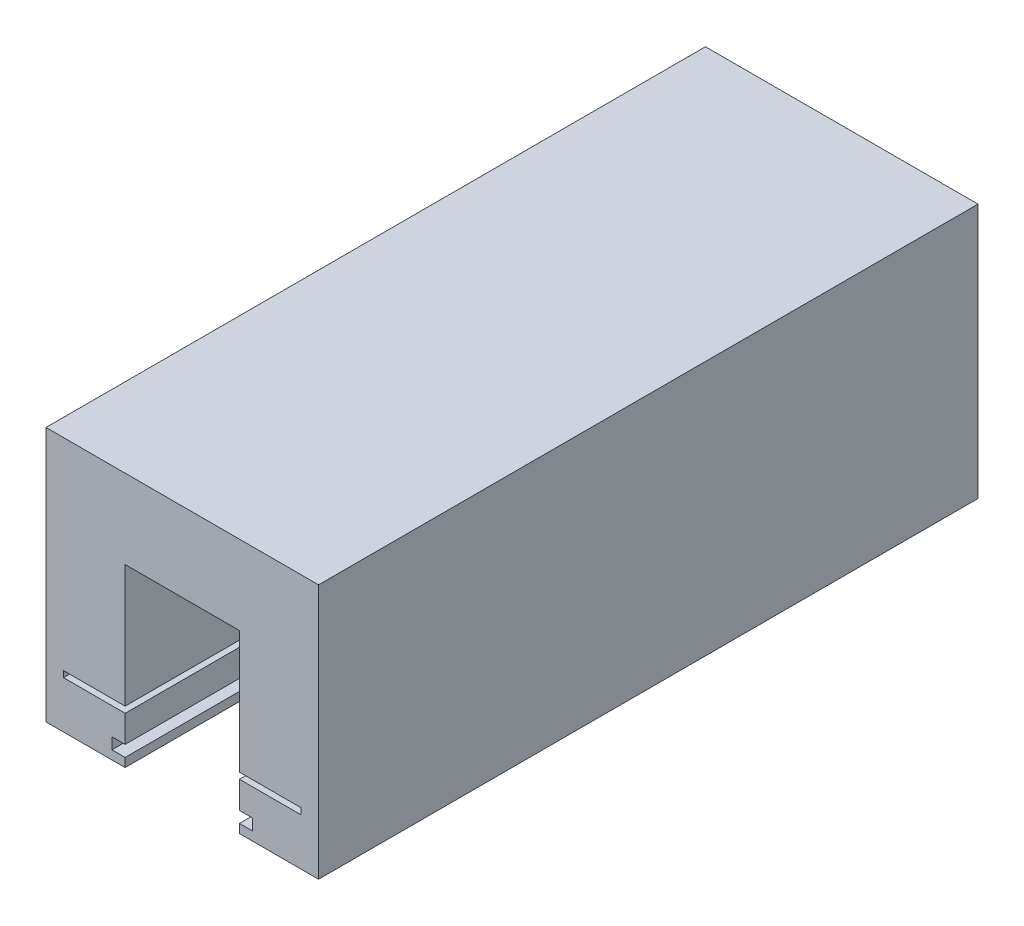
ISO-10303-21;
HEADER;
FILE_DESCRIPTION(('STEP AP214'),'2;1');
FILE_NAME('part.step','',(''),(''),'','','');
FILE_SCHEMA(('AUTOMOTIVE_DESIGN { 1 0 10303 214 1 1 1 1 }'));
ENDSEC;
DATA;
#1=APPLICATION_CONTEXT('core data for automotive mechanical design processes');
#2=APPLICATION_PROTOCOL_DEFINITION('international standard','automotive_design',2000,#1);
#3=PRODUCT_CONTEXT('',#1,'mechanical');
#4=PRODUCT('Part','Part','',(#3));
#5=PRODUCT_RELATED_PRODUCT_CATEGORY('part','',(#4));
#6=PRODUCT_DEFINITION_FORMATION('','',#4);
#7=PRODUCT_DEFINITION_CONTEXT('part definition',#1,'design');
#8=PRODUCT_DEFINITION('design','',#6,#7);
#9=PRODUCT_DEFINITION_SHAPE('','',#8);
#10=(LENGTH_UNIT() NAMED_UNIT(*) SI_UNIT(.MILLI.,.METRE.));
#11=(NAMED_UNIT(*) PLANE_ANGLE_UNIT() SI_UNIT($,.RADIAN.));
#12=(NAMED_UNIT(*) SI_UNIT($,.STERADIAN.) SOLID_ANGLE_UNIT());
#13=UNCERTAINTY_MEASURE_WITH_UNIT(LENGTH_MEASURE(1.E-05),#10,'distance_accuracy_value','');
#14=(GEOMETRIC_REPRESENTATION_CONTEXT(3) GLOBAL_UNCERTAINTY_ASSIGNED_CONTEXT((#13)) GLOBAL_UNIT_ASSIGNED_CONTEXT((#10,
#11,#12)) REPRESENTATION_CONTEXT('',''));
#15=CARTESIAN_POINT('',(0.,0.,0.));
#16=DIRECTION('',(0.,0.,1.));
#17=DIRECTION('',(1.,0.,0.));
#18=AXIS2_PLACEMENT_3D('',#15,#16,#17);
#19=CARTESIAN_POINT('',(0.,6.04999999999999,75.));
#20=DIRECTION('',(0.,-1.,0.));
#21=DIRECTION('',(1.,0.,0.));
#22=AXIS2_PLACEMENT_3D('',#19,#20,#21);
#23=PLANE('',#22);
#24=DIRECTION('',(-1.,0.,0.));
#25=VECTOR('',#24,1.);
#26=CARTESIAN_POINT('',(0.,6.04999999999999,0.));
#27=LINE('',#26,#25);
#28=CARTESIAN_POINT('',(-2.,6.04999999999999,0.));
#29=VERTEX_POINT('',#28);
#30=CARTESIAN_POINT('',(-9.,6.04999999999999,0.));
#31=VERTEX_POINT('',#30);
#32=EDGE_CURVE('E228',#29,#31,#27,.T.);
#33=ORIENTED_EDGE('',*,*,#32,.F.);
#34=DIRECTION('',(0.,0.,-1.));
#35=VECTOR('',#34,1.);
#36=CARTESIAN_POINT('',(-2.,6.04999999999999,75.));
#37=LINE('',#36,#35);
#38=CARTESIAN_POINT('',(-2.,6.04999999999999,75.));
#39=VERTEX_POINT('',#38);
#40=EDGE_CURVE('E11',#39,#29,#37,.T.);
#41=ORIENTED_EDGE('',*,*,#40,.F.);
#42=DIRECTION('',(-1.,0.,0.));
#43=VECTOR('',#42,1.);
#44=CARTESIAN_POINT('',(0.,6.04999999999999,75.));
#45=LINE('',#44,#43);
#46=CARTESIAN_POINT('',(-9.,6.04999999999999,75.));
#47=VERTEX_POINT('',#46);
#48=EDGE_CURVE('E351',#39,#47,#45,.T.);
#49=ORIENTED_EDGE('',*,*,#48,.T.);
#50=DIRECTION('',(0.,0.,-1.));
#51=VECTOR('',#50,1.);
#52=CARTESIAN_POINT('',(-9.,6.04999999999999,75.));
#53=LINE('',#52,#51);
#54=EDGE_CURVE('E51',#47,#31,#53,.T.);
#55=ORIENTED_EDGE('',*,*,#54,.T.);
#56=EDGE_LOOP('',(#33,#41,#49,#55));
#57=FACE_BOUND('',#56,.T.);
#58=ADVANCED_FACE('F35',(#57),#23,.T.);
#59=CARTESIAN_POINT('',(-2.,0.,75.));
#60=DIRECTION('',(-1.,0.,0.));
#61=DIRECTION('',(0.,0.,1.));
#62=AXIS2_PLACEMENT_3D('',#59,#60,#61);
#63=PLANE('',#62);
#64=DIRECTION('',(0.,1.,0.));
#65=VECTOR('',#64,1.);
#66=CARTESIAN_POINT('',(-2.,0.,0.));
#67=LINE('',#66,#65);
#68=CARTESIAN_POINT('',(-2.,5.34999999999999,0.));
#69=VERTEX_POINT('',#68);
#70=EDGE_CURVE('E230',#69,#29,#67,.T.);
#71=ORIENTED_EDGE('',*,*,#70,.F.);
#72=DIRECTION('',(0.,0.,-1.));
#73=VECTOR('',#72,1.);
#74=CARTESIAN_POINT('',(-2.,5.34999999999999,75.));
#75=LINE('',#74,#73);
#76=CARTESIAN_POINT('',(-2.,5.34999999999999,75.));
#77=VERTEX_POINT('',#76);
#78=EDGE_CURVE('E43',#77,#69,#75,.T.);
#79=ORIENTED_EDGE('',*,*,#78,.F.);
#80=DIRECTION('',(0.,1.,0.));
#81=VECTOR('',#80,1.);
#82=CARTESIAN_POINT('',(-2.,0.,75.));
#83=LINE('',#82,#81);
#84=EDGE_CURVE('E348',#77,#39,#83,.T.);
#85=ORIENTED_EDGE('',*,*,#84,.T.);
#86=ORIENTED_EDGE('',*,*,#40,.T.);
#87=EDGE_LOOP('',(#71,#79,#85,#86));
#88=FACE_BOUND('',#87,.T.);
#89=ADVANCED_FACE('F337',(#88),#63,.T.);
#90=CARTESIAN_POINT('',(0.,5.34999999999999,75.));
#91=DIRECTION('',(0.,1.,0.));
#92=DIRECTION('',(0.,0.,1.));
#93=AXIS2_PLACEMENT_3D('',#90,#91,#92);
#94=PLANE('',#93);
#95=DIRECTION('',(1.,0.,0.));
#96=VECTOR('',#95,1.);
#97=CARTESIAN_POINT('',(0.,5.34999999999999,0.));
#98=LINE('',#97,#96);
#99=CARTESIAN_POINT('',(-9.,5.34999999999999,0.));
#100=VERTEX_POINT('',#99);
#101=EDGE_CURVE('E233',#100,#69,#98,.T.);
#102=ORIENTED_EDGE('',*,*,#101,.F.);
#103=DIRECTION('',(0.,0.,-1.));
#104=VECTOR('',#103,1.);
#105=CARTESIAN_POINT('',(-9.,5.34999999999999,75.));
#106=LINE('',#105,#104);
#107=CARTESIAN_POINT('',(-9.,5.34999999999999,75.));
#108=VERTEX_POINT('',#107);
#109=EDGE_CURVE('E326',#108,#100,#106,.T.);
#110=ORIENTED_EDGE('',*,*,#109,.F.);
#111=DIRECTION('',(1.,0.,0.));
#112=VECTOR('',#111,1.);
#113=CARTESIAN_POINT('',(0.,5.34999999999999,75.));
#114=LINE('',#113,#112);
#115=EDGE_CURVE('E333',#108,#77,#114,.T.);
#116=ORIENTED_EDGE('',*,*,#115,.T.);
#117=ORIENTED_EDGE('',*,*,#78,.T.);
#118=EDGE_LOOP('',(#102,#110,#116,#117));
#119=FACE_BOUND('',#118,.T.);
#120=ADVANCED_FACE('F331',(#119),#94,.T.);
#121=CARTESIAN_POINT('',(-9.,0.,75.));
#122=DIRECTION('',(-1.,0.,0.));
#123=DIRECTION('',(0.,0.,1.));
#124=AXIS2_PLACEMENT_3D('',#121,#122,#123);
#125=PLANE('',#124);
#126=DIRECTION('',(0.,1.,0.));
#127=VECTOR('',#126,1.);
#128=CARTESIAN_POINT('',(-9.,0.,0.));
#129=LINE('',#128,#127);
#130=CARTESIAN_POINT('',(-9.,2.28,0.));
#131=VERTEX_POINT('',#130);
#132=EDGE_CURVE('E236',#131,#100,#129,.T.);
#133=ORIENTED_EDGE('',*,*,#132,.F.);
#134=DIRECTION('',(0.,0.,-1.));
#135=VECTOR('',#134,1.);
#136=CARTESIAN_POINT('',(-9.,2.28,75.));
#137=LINE('',#136,#135);
#138=CARTESIAN_POINT('',(-9.,2.28,75.));
#139=VERTEX_POINT('',#138);
#140=EDGE_CURVE('E324',#139,#131,#137,.T.);
#141=ORIENTED_EDGE('',*,*,#140,.F.);
#142=DIRECTION('',(0.,1.,0.));
#143=VECTOR('',#142,1.);
#144=CARTESIAN_POINT('',(-9.,0.,75.));
#145=LINE('',#144,#143);
#146=EDGE_CURVE('E224',#139,#108,#145,.T.);
#147=ORIENTED_EDGE('',*,*,#146,.T.);
#148=ORIENTED_EDGE('',*,*,#109,.T.);
#149=EDGE_LOOP('',(#133,#141,#147,#148));
#150=FACE_BOUND('',#149,.T.);
#151=ADVANCED_FACE('F343',(#150),#125,.T.);
#152=CARTESIAN_POINT('',(0.,2.28,75.));
#153=DIRECTION('',(0.,-1.,0.));
#154=DIRECTION('',(0.,0.,-1.));
#155=AXIS2_PLACEMENT_3D('',#152,#153,#154);
#156=PLANE('',#155);
#157=DIRECTION('',(-1.,0.,0.));
#158=VECTOR('',#157,1.);
#159=CARTESIAN_POINT('',(0.,2.28,0.));
#160=LINE('',#159,#158);
#161=CARTESIAN_POINT('',(-7.5,2.28,0.));
#162=VERTEX_POINT('',#161);
#163=EDGE_CURVE('E239',#162,#131,#160,.T.);
#164=ORIENTED_EDGE('',*,*,#163,.F.);
#165=DIRECTION('',(0.,0.,-1.));
#166=VECTOR('',#165,1.);
#167=CARTESIAN_POINT('',(-7.5,2.28,75.));
#168=LINE('',#167,#166);
#169=CARTESIAN_POINT('',(-7.5,2.28,75.));
#170=VERTEX_POINT('',#169);
#171=EDGE_CURVE('E322',#170,#162,#168,.T.);
#172=ORIENTED_EDGE('',*,*,#171,.F.);
#173=DIRECTION('',(-1.,0.,0.));
#174=VECTOR('',#173,1.);
#175=CARTESIAN_POINT('',(0.,2.28,75.));
#176=LINE('',#175,#174);
#177=EDGE_CURVE('E350',#170,#139,#176,.T.);
#178=ORIENTED_EDGE('',*,*,#177,.T.);
#179=ORIENTED_EDGE('',*,*,#140,.T.);
#180=EDGE_LOOP('',(#164,#172,#178,#179));
#181=FACE_BOUND('',#180,.T.);
#182=ADVANCED_FACE('F460',(#181),#156,.T.);
#183=CARTESIAN_POINT('',(-7.5,0.,75.));
#184=DIRECTION('',(-1.,0.,0.));
#185=DIRECTION('',(0.,0.,1.));
#186=AXIS2_PLACEMENT_3D('',#183,#184,#185);
#187=PLANE('',#186);
#188=DIRECTION('',(0.,1.,0.));
#189=VECTOR('',#188,1.);
#190=CARTESIAN_POINT('',(-7.5,0.,0.));
#191=LINE('',#190,#189);
#192=CARTESIAN_POINT('',(-7.5,0.999999999999999,0.));
#193=VERTEX_POINT('',#192);
#194=EDGE_CURVE('E244',#193,#162,#191,.T.);
#195=ORIENTED_EDGE('',*,*,#194,.F.);
#196=DIRECTION('',(0.,0.,-1.));
#197=VECTOR('',#196,1.);
#198=CARTESIAN_POINT('',(-7.5,0.999999999999999,75.));
#199=LINE('',#198,#197);
#200=CARTESIAN_POINT('',(-7.5,0.999999999999999,75.));
#201=VERTEX_POINT('',#200);
#202=EDGE_CURVE('E320',#201,#193,#199,.T.);
#203=ORIENTED_EDGE('',*,*,#202,.F.);
#204=DIRECTION('',(0.,1.,0.));
#205=VECTOR('',#204,1.);
#206=CARTESIAN_POINT('',(-7.5,0.,75.));
#207=LINE('',#206,#205);
#208=EDGE_CURVE('E356',#201,#170,#207,.T.);
#209=ORIENTED_EDGE('',*,*,#208,.T.);
#210=ORIENTED_EDGE('',*,*,#171,.T.);
#211=EDGE_LOOP('',(#195,#203,#209,#210));
#212=FACE_BOUND('',#211,.T.);
#213=ADVANCED_FACE('F474',(#212),#187,.T.);
#214=CARTESIAN_POINT('',(0.,0.999999999999999,75.));
#215=DIRECTION('',(0.,1.,0.));
#216=DIRECTION('',(0.,0.,1.));
#217=AXIS2_PLACEMENT_3D('',#214,#215,#216);
#218=PLANE('',#217);
#219=DIRECTION('',(1.,0.,0.));
#220=VECTOR('',#219,1.);
#221=CARTESIAN_POINT('',(0.,0.999999999999999,0.));
#222=LINE('',#221,#220);
#223=CARTESIAN_POINT('',(-9.,0.999999999999999,0.));
#224=VERTEX_POINT('',#223);
#225=EDGE_CURVE('E247',#224,#193,#222,.T.);
#226=ORIENTED_EDGE('',*,*,#225,.F.);
#227=DIRECTION('',(0.,0.,-1.));
#228=VECTOR('',#227,1.);
#229=CARTESIAN_POINT('',(-9.,0.999999999999999,75.));
#230=LINE('',#229,#228);
#231=CARTESIAN_POINT('',(-9.,0.999999999999999,75.));
#232=VERTEX_POINT('',#231);
#233=EDGE_CURVE('E318',#232,#224,#230,.T.);
#234=ORIENTED_EDGE('',*,*,#233,.F.);
#235=DIRECTION('',(1.,0.,0.));
#236=VECTOR('',#235,1.);
#237=CARTESIAN_POINT('',(0.,0.999999999999999,75.));
#238=LINE('',#237,#236);
#239=EDGE_CURVE('E359',#232,#201,#238,.T.);
#240=ORIENTED_EDGE('',*,*,#239,.T.);
#241=ORIENTED_EDGE('',*,*,#202,.T.);
#242=EDGE_LOOP('',(#226,#234,#240,#241));
#243=FACE_BOUND('',#242,.T.);
#244=ADVANCED_FACE('F462',(#243),#218,.T.);
#245=CARTESIAN_POINT('',(-9.,0.,0.));
#246=VERTEX_POINT('',#245);
#247=EDGE_CURVE('E241',#246,#224,#129,.T.);
#248=ORIENTED_EDGE('',*,*,#247,.F.);
#249=DIRECTION('',(0.,0.,-1.));
#250=VECTOR('',#249,1.);
#251=CARTESIAN_POINT('',(-9.,0.,75.));
#252=LINE('',#251,#250);
#253=CARTESIAN_POINT('',(-9.,0.,75.));
#254=VERTEX_POINT('',#253);
#255=EDGE_CURVE('E316',#254,#246,#252,.T.);
#256=ORIENTED_EDGE('',*,*,#255,.F.);
#257=EDGE_CURVE('E223',#254,#232,#145,.T.);
#258=ORIENTED_EDGE('',*,*,#257,.T.);
#259=ORIENTED_EDGE('',*,*,#233,.T.);
#260=EDGE_LOOP('',(#248,#256,#258,#259));
#261=FACE_BOUND('',#260,.T.);
#262=ADVANCED_FACE('F447',(#261),#125,.T.);
#263=CARTESIAN_POINT('',(0.,0.,75.));
#264=DIRECTION('',(0.,-1.,0.));
#265=DIRECTION('',(1.,0.,0.));
#266=AXIS2_PLACEMENT_3D('',#263,#264,#265);
#267=PLANE('',#266);
#268=DIRECTION('',(-1.,0.,0.));
#269=VECTOR('',#268,1.);
#270=CARTESIAN_POINT('',(0.,0.,0.));
#271=LINE('',#270,#269);
#272=CARTESIAN_POINT('',(0.,0.,0.));
#273=VERTEX_POINT('',#272);
#274=EDGE_CURVE('E250',#273,#246,#271,.T.);
#275=ORIENTED_EDGE('',*,*,#274,.F.);
#276=DIRECTION('',(0.,0.,-1.));
#277=VECTOR('',#276,1.);
#278=CARTESIAN_POINT('',(0.,0.,75.));
#279=LINE('',#278,#277);
#280=CARTESIAN_POINT('',(0.,0.,75.));
#281=VERTEX_POINT('',#280);
#282=EDGE_CURVE('E314',#281,#273,#279,.T.);
#283=ORIENTED_EDGE('',*,*,#282,.F.);
#284=DIRECTION('',(-1.,0.,0.));
#285=VECTOR('',#284,1.);
#286=CARTESIAN_POINT('',(0.,0.,75.));
#287=LINE('',#286,#285);
#288=EDGE_CURVE('E362',#281,#254,#287,.T.);
#289=ORIENTED_EDGE('',*,*,#288,.T.);
#290=ORIENTED_EDGE('',*,*,#255,.T.);
#291=EDGE_LOOP('',(#275,#283,#289,#290));
#292=FACE_BOUND('',#291,.T.);
#293=ADVANCED_FACE('F442',(#292),#267,.T.);
#294=CARTESIAN_POINT('',(0.,0.,75.));
#295=DIRECTION('',(1.,0.,0.));
#296=DIRECTION('',(0.,0.,-1.));
#297=AXIS2_PLACEMENT_3D('',#294,#295,#296);
#298=PLANE('',#297);
#299=DIRECTION('',(0.,-1.,0.));
#300=VECTOR('',#299,1.);
#301=CARTESIAN_POINT('',(0.,0.,0.));
#302=LINE('',#301,#300);
#303=CARTESIAN_POINT('',(0.,29.,0.));
#304=VERTEX_POINT('',#303);
#305=EDGE_CURVE('E253',#304,#273,#302,.T.);
#306=ORIENTED_EDGE('',*,*,#305,.F.);
#307=DIRECTION('',(0.,0.,-1.));
#308=VECTOR('',#307,1.);
#309=CARTESIAN_POINT('',(0.,29.,75.));
#310=LINE('',#309,#308);
#311=CARTESIAN_POINT('',(0.,29.,75.));
#312=VERTEX_POINT('',#311);
#313=EDGE_CURVE('E312',#312,#304,#310,.T.);
#314=ORIENTED_EDGE('',*,*,#313,.F.);
#315=DIRECTION('',(0.,-1.,0.));
#316=VECTOR('',#315,1.);
#317=CARTESIAN_POINT('',(0.,0.,75.));
#318=LINE('',#317,#316);
#319=EDGE_CURVE('E365',#312,#281,#318,.T.);
#320=ORIENTED_EDGE('',*,*,#319,.T.);
#321=ORIENTED_EDGE('',*,*,#282,.T.);
#322=EDGE_LOOP('',(#306,#314,#320,#321));
#323=FACE_BOUND('',#322,.T.);
#324=ADVANCED_FACE('F437',(#323),#298,.T.);
#325=CARTESIAN_POINT('',(0.,29.,75.));
#326=DIRECTION('',(0.,1.,0.));
#327=DIRECTION('',(-1.,0.,0.));
#328=AXIS2_PLACEMENT_3D('',#325,#326,#327);
#329=PLANE('',#328);
#330=DIRECTION('',(1.,0.,0.));
#331=VECTOR('',#330,1.);
#332=CARTESIAN_POINT('',(0.,29.,0.));
#333=LINE('',#332,#331);
#334=CARTESIAN_POINT('',(-31.,29.,0.));
#335=VERTEX_POINT('',#334);
#336=EDGE_CURVE('E256',#335,#304,#333,.T.);
#337=ORIENTED_EDGE('',*,*,#336,.F.);
#338=DIRECTION('',(0.,0.,-1.));
#339=VECTOR('',#338,1.);
#340=CARTESIAN_POINT('',(-31.,29.,75.));
#341=LINE('',#340,#339);
#342=CARTESIAN_POINT('',(-31.,29.,75.));
#343=VERTEX_POINT('',#342);
#344=EDGE_CURVE('E310',#343,#335,#341,.T.);
#345=ORIENTED_EDGE('',*,*,#344,.F.);
#346=DIRECTION('',(1.,0.,0.));
#347=VECTOR('',#346,1.);
#348=CARTESIAN_POINT('',(0.,29.,75.));
#349=LINE('',#348,#347);
#350=EDGE_CURVE('E368',#343,#312,#349,.T.);
#351=ORIENTED_EDGE('',*,*,#350,.T.);
#352=ORIENTED_EDGE('',*,*,#313,.T.);
#353=EDGE_LOOP('',(#337,#345,#351,#352));
#354=FACE_BOUND('',#353,.T.);
#355=ADVANCED_FACE('F433',(#354),#329,.T.);
#356=CARTESIAN_POINT('',(-31.,0.,75.));
#357=DIRECTION('',(-1.,0.,0.));
#358=DIRECTION('',(0.,0.,1.));
#359=AXIS2_PLACEMENT_3D('',#356,#357,#358);
#360=PLANE('',#359);
#361=DIRECTION('',(0.,1.,0.));
#362=VECTOR('',#361,1.);
#363=CARTESIAN_POINT('',(-31.,0.,0.));
#364=LINE('',#363,#362);
#365=CARTESIAN_POINT('',(-31.,0.,0.));
#366=VERTEX_POINT('',#365);
#367=EDGE_CURVE('E259',#366,#335,#364,.T.);
#368=ORIENTED_EDGE('',*,*,#367,.F.);
#369=DIRECTION('',(0.,0.,-1.));
#370=VECTOR('',#369,1.);
#371=CARTESIAN_POINT('',(-31.,0.,75.));
#372=LINE('',#371,#370);
#373=CARTESIAN_POINT('',(-31.,0.,75.));
#374=VERTEX_POINT('',#373);
#375=EDGE_CURVE('E308',#374,#366,#372,.T.);
#376=ORIENTED_EDGE('',*,*,#375,.F.);
#377=DIRECTION('',(0.,1.,0.));
#378=VECTOR('',#377,1.);
#379=CARTESIAN_POINT('',(-31.,0.,75.));
#380=LINE('',#379,#378);
#381=EDGE_CURVE('E371',#374,#343,#380,.T.);
#382=ORIENTED_EDGE('',*,*,#381,.T.);
#383=ORIENTED_EDGE('',*,*,#344,.T.);
#384=EDGE_LOOP('',(#368,#376,#382,#383));
#385=FACE_BOUND('',#384,.T.);
#386=ADVANCED_FACE('F429',(#385),#360,.T.);
#387=CARTESIAN_POINT('',(0.,0.,75.));
#388=DIRECTION('',(0.,-1.,0.));
#389=DIRECTION('',(1.,0.,0.));
#390=AXIS2_PLACEMENT_3D('',#387,#388,#389);
#391=PLANE('',#390);
#392=DIRECTION('',(-1.,0.,0.));
#393=VECTOR('',#392,1.);
#394=CARTESIAN_POINT('',(0.,0.,0.));
#395=LINE('',#394,#393);
#396=CARTESIAN_POINT('',(-22.,0.,0.));
#397=VERTEX_POINT('',#396);
#398=EDGE_CURVE('E262',#397,#366,#395,.T.);
#399=ORIENTED_EDGE('',*,*,#398,.F.);
#400=DIRECTION('',(0.,0.,-1.));
#401=VECTOR('',#400,1.);
#402=CARTESIAN_POINT('',(-22.,0.,75.));
#403=LINE('',#402,#401);
#404=CARTESIAN_POINT('',(-22.,0.,75.));
#405=VERTEX_POINT('',#404);
#406=EDGE_CURVE('E306',#405,#397,#403,.T.);
#407=ORIENTED_EDGE('',*,*,#406,.F.);
#408=DIRECTION('',(-1.,0.,0.));
#409=VECTOR('',#408,1.);
#410=CARTESIAN_POINT('',(0.,0.,75.));
#411=LINE('',#410,#409);
#412=EDGE_CURVE('E374',#405,#374,#411,.T.);
#413=ORIENTED_EDGE('',*,*,#412,.T.);
#414=ORIENTED_EDGE('',*,*,#375,.T.);
#415=EDGE_LOOP('',(#399,#407,#413,#414));
#416=FACE_BOUND('',#415,.T.);
#417=ADVANCED_FACE('F425',(#416),#391,.T.);
#418=CARTESIAN_POINT('',(-22.,0.,75.));
#419=DIRECTION('',(1.,0.,0.));
#420=DIRECTION('',(0.,1.,0.));
#421=AXIS2_PLACEMENT_3D('',#418,#419,#420);
#422=PLANE('',#421);
#423=DIRECTION('',(0.,-1.,0.));
#424=VECTOR('',#423,1.);
#425=CARTESIAN_POINT('',(-22.,0.,0.));
#426=LINE('',#425,#424);
#427=CARTESIAN_POINT('',(-22.,0.999999999999997,0.));
#428=VERTEX_POINT('',#427);
#429=EDGE_CURVE('E265',#428,#397,#426,.T.);
#430=ORIENTED_EDGE('',*,*,#429,.F.);
#431=DIRECTION('',(0.,0.,-1.));
#432=VECTOR('',#431,1.);
#433=CARTESIAN_POINT('',(-22.,0.999999999999997,75.));
#434=LINE('',#433,#432);
#435=CARTESIAN_POINT('',(-22.,0.999999999999997,75.));
#436=VERTEX_POINT('',#435);
#437=EDGE_CURVE('E304',#436,#428,#434,.T.);
#438=ORIENTED_EDGE('',*,*,#437,.F.);
#439=DIRECTION('',(0.,-1.,0.));
#440=VECTOR('',#439,1.);
#441=CARTESIAN_POINT('',(-22.,0.,75.));
#442=LINE('',#441,#440);
#443=EDGE_CURVE('E218',#436,#405,#442,.T.);
#444=ORIENTED_EDGE('',*,*,#443,.T.);
#445=ORIENTED_EDGE('',*,*,#406,.T.);
#446=EDGE_LOOP('',(#430,#438,#444,#445));
#447=FACE_BOUND('',#446,.T.);
#448=ADVANCED_FACE('F419',(#447),#422,.T.);
#449=CARTESIAN_POINT('',(0.,0.999999999999997,75.));
#450=DIRECTION('',(0.,-1.,0.));
#451=DIRECTION('',(0.,0.,-1.));
#452=AXIS2_PLACEMENT_3D('',#449,#450,#451);
#453=PLANE('',#452);
#454=DIRECTION('',(-1.,0.,0.));
#455=VECTOR('',#454,1.);
#456=CARTESIAN_POINT('',(0.,0.999999999999997,0.));
#457=LINE('',#456,#455);
#458=CARTESIAN_POINT('',(-23.5,0.999999999999997,0.));
#459=VERTEX_POINT('',#458);
#460=EDGE_CURVE('E268',#428,#459,#457,.T.);
#461=ORIENTED_EDGE('',*,*,#460,.T.);
#462=DIRECTION('',(0.,0.,-1.));
#463=VECTOR('',#462,1.);
#464=CARTESIAN_POINT('',(-23.5,0.999999999999997,75.));
#465=LINE('',#464,#463);
#466=CARTESIAN_POINT('',(-23.5,0.999999999999997,75.));
#467=VERTEX_POINT('',#466);
#468=EDGE_CURVE('E301',#467,#459,#465,.T.);
#469=ORIENTED_EDGE('',*,*,#468,.F.);
#470=DIRECTION('',(-1.,0.,0.));
#471=VECTOR('',#470,1.);
#472=CARTESIAN_POINT('',(0.,0.999999999999997,75.));
#473=LINE('',#472,#471);
#474=EDGE_CURVE('E378',#436,#467,#473,.T.);
#475=ORIENTED_EDGE('',*,*,#474,.F.);
#476=ORIENTED_EDGE('',*,*,#437,.T.);
#477=EDGE_LOOP('',(#461,#469,#475,#476));
#478=FACE_BOUND('',#477,.T.);
#479=ADVANCED_FACE('F492',(#478),#453,.F.);
#480=CARTESIAN_POINT('',(-23.5,0.,75.));
#481=DIRECTION('',(-1.,0.,0.));
#482=DIRECTION('',(0.,0.,1.));
#483=AXIS2_PLACEMENT_3D('',#480,#481,#482);
#484=PLANE('',#483);
#485=DIRECTION('',(0.,1.,0.));
#486=VECTOR('',#485,1.);
#487=CARTESIAN_POINT('',(-23.5,0.,0.));
#488=LINE('',#487,#486);
#489=CARTESIAN_POINT('',(-23.5,2.28,0.));
#490=VERTEX_POINT('',#489);
#491=EDGE_CURVE('E271',#459,#490,#488,.T.);
#492=ORIENTED_EDGE('',*,*,#491,.T.);
#493=DIRECTION('',(0.,0.,-1.));
#494=VECTOR('',#493,1.);
#495=CARTESIAN_POINT('',(-23.5,2.28,75.));
#496=LINE('',#495,#494);
#497=CARTESIAN_POINT('',(-23.5,2.28,75.));
#498=VERTEX_POINT('',#497);
#499=EDGE_CURVE('E298',#498,#490,#496,.T.);
#500=ORIENTED_EDGE('',*,*,#499,.F.);
#501=DIRECTION('',(0.,1.,0.));
#502=VECTOR('',#501,1.);
#503=CARTESIAN_POINT('',(-23.5,0.,75.));
#504=LINE('',#503,#502);
#505=EDGE_CURVE('E380',#467,#498,#504,.T.);
#506=ORIENTED_EDGE('',*,*,#505,.F.);
#507=ORIENTED_EDGE('',*,*,#468,.T.);
#508=EDGE_LOOP('',(#492,#500,#506,#507));
#509=FACE_BOUND('',#508,.T.);
#510=ADVANCED_FACE('F413',(#509),#484,.F.);
#511=CARTESIAN_POINT('',(0.,2.28,75.));
#512=DIRECTION('',(0.,1.,0.));
#513=DIRECTION('',(0.,0.,1.));
#514=AXIS2_PLACEMENT_3D('',#511,#512,#513);
#515=PLANE('',#514);
#516=DIRECTION('',(1.,0.,0.));
#517=VECTOR('',#516,1.);
#518=CARTESIAN_POINT('',(0.,2.28,0.));
#519=LINE('',#518,#517);
#520=CARTESIAN_POINT('',(-22.,2.28,0.));
#521=VERTEX_POINT('',#520);
#522=EDGE_CURVE('E273',#490,#521,#519,.T.);
#523=ORIENTED_EDGE('',*,*,#522,.T.);
#524=DIRECTION('',(0.,0.,-1.));
#525=VECTOR('',#524,1.);
#526=CARTESIAN_POINT('',(-22.,2.28,75.));
#527=LINE('',#526,#525);
#528=CARTESIAN_POINT('',(-22.,2.28,75.));
#529=VERTEX_POINT('',#528);
#530=EDGE_CURVE('E296',#529,#521,#527,.T.);
#531=ORIENTED_EDGE('',*,*,#530,.F.);
#532=DIRECTION('',(1.,0.,0.));
#533=VECTOR('',#532,1.);
#534=CARTESIAN_POINT('',(0.,2.28,75.));
#535=LINE('',#534,#533);
#536=EDGE_CURVE('E382',#498,#529,#535,.T.);
#537=ORIENTED_EDGE('',*,*,#536,.F.);
#538=ORIENTED_EDGE('',*,*,#499,.T.);
#539=EDGE_LOOP('',(#523,#531,#537,#538));
#540=FACE_BOUND('',#539,.T.);
#541=ADVANCED_FACE('F409',(#540),#515,.F.);
#542=CARTESIAN_POINT('',(-22.,5.35,0.));
#543=VERTEX_POINT('',#542);
#544=EDGE_CURVE('E269',#543,#521,#426,.T.);
#545=ORIENTED_EDGE('',*,*,#544,.F.);
#546=DIRECTION('',(0.,0.,-1.));
#547=VECTOR('',#546,1.);
#548=CARTESIAN_POINT('',(-22.,5.35,75.));
#549=LINE('',#548,#547);
#550=CARTESIAN_POINT('',(-22.,5.35,75.));
#551=VERTEX_POINT('',#550);
#552=EDGE_CURVE('E294',#551,#543,#549,.T.);
#553=ORIENTED_EDGE('',*,*,#552,.F.);
#554=EDGE_CURVE('E217',#551,#529,#442,.T.);
#555=ORIENTED_EDGE('',*,*,#554,.T.);
#556=ORIENTED_EDGE('',*,*,#530,.T.);
#557=EDGE_LOOP('',(#545,#553,#555,#556));
#558=FACE_BOUND('',#557,.T.);
#559=ADVANCED_FACE('F404',(#558),#422,.T.);
#560=CARTESIAN_POINT('',(0.,5.35,75.));
#561=DIRECTION('',(0.,-1.,0.));
#562=DIRECTION('',(0.,0.,-1.));
#563=AXIS2_PLACEMENT_3D('',#560,#561,#562);
#564=PLANE('',#563);
#565=DIRECTION('',(-1.,0.,0.));
#566=VECTOR('',#565,1.);
#567=CARTESIAN_POINT('',(0.,5.35,0.));
#568=LINE('',#567,#566);
#569=CARTESIAN_POINT('',(-29.,5.35,0.));
#570=VERTEX_POINT('',#569);
#571=EDGE_CURVE('E276',#543,#570,#568,.T.);
#572=ORIENTED_EDGE('',*,*,#571,.T.);
#573=DIRECTION('',(0.,0.,-1.));
#574=VECTOR('',#573,1.);
#575=CARTESIAN_POINT('',(-29.,5.35,75.));
#576=LINE('',#575,#574);
#577=CARTESIAN_POINT('',(-29.,5.35,75.));
#578=VERTEX_POINT('',#577);
#579=EDGE_CURVE('E291',#578,#570,#576,.T.);
#580=ORIENTED_EDGE('',*,*,#579,.F.);
#581=DIRECTION('',(-1.,0.,0.));
#582=VECTOR('',#581,1.);
#583=CARTESIAN_POINT('',(0.,5.35,75.));
#584=LINE('',#583,#582);
#585=EDGE_CURVE('E384',#551,#578,#584,.T.);
#586=ORIENTED_EDGE('',*,*,#585,.F.);
#587=ORIENTED_EDGE('',*,*,#552,.T.);
#588=EDGE_LOOP('',(#572,#580,#586,#587));
#589=FACE_BOUND('',#588,.T.);
#590=ADVANCED_FACE('F499',(#589),#564,.F.);
#591=CARTESIAN_POINT('',(-29.,0.,75.));
#592=DIRECTION('',(-1.,0.,0.));
#593=DIRECTION('',(0.,0.,1.));
#594=AXIS2_PLACEMENT_3D('',#591,#592,#593);
#595=PLANE('',#594);
#596=DIRECTION('',(0.,1.,0.));
#597=VECTOR('',#596,1.);
#598=CARTESIAN_POINT('',(-29.,0.,0.));
#599=LINE('',#598,#597);
#600=CARTESIAN_POINT('',(-29.,6.05,0.));
#601=VERTEX_POINT('',#600);
#602=EDGE_CURVE('E278',#570,#601,#599,.T.);
#603=ORIENTED_EDGE('',*,*,#602,.T.);
#604=DIRECTION('',(0.,0.,-1.));
#605=VECTOR('',#604,1.);
#606=CARTESIAN_POINT('',(-29.,6.05,75.));
#607=LINE('',#606,#605);
#608=CARTESIAN_POINT('',(-29.,6.05,75.));
#609=VERTEX_POINT('',#608);
#610=EDGE_CURVE('E288',#609,#601,#607,.T.);
#611=ORIENTED_EDGE('',*,*,#610,.F.);
#612=DIRECTION('',(0.,1.,0.));
#613=VECTOR('',#612,1.);
#614=CARTESIAN_POINT('',(-29.,0.,75.));
#615=LINE('',#614,#613);
#616=EDGE_CURVE('E385',#578,#609,#615,.T.);
#617=ORIENTED_EDGE('',*,*,#616,.F.);
#618=ORIENTED_EDGE('',*,*,#579,.T.);
#619=EDGE_LOOP('',(#603,#611,#617,#618));
#620=FACE_BOUND('',#619,.T.);
#621=ADVANCED_FACE('F392',(#620),#595,.F.);
#622=CARTESIAN_POINT('',(0.,6.05,75.));
#623=DIRECTION('',(0.,1.,0.));
#624=DIRECTION('',(0.,0.,1.));
#625=AXIS2_PLACEMENT_3D('',#622,#623,#624);
#626=PLANE('',#625);
#627=DIRECTION('',(1.,0.,0.));
#628=VECTOR('',#627,1.);
#629=CARTESIAN_POINT('',(0.,6.05,0.));
#630=LINE('',#629,#628);
#631=CARTESIAN_POINT('',(-22.,6.05,0.));
#632=VERTEX_POINT('',#631);
#633=EDGE_CURVE('E280',#601,#632,#630,.T.);
#634=ORIENTED_EDGE('',*,*,#633,.T.);
#635=DIRECTION('',(0.,0.,-1.));
#636=VECTOR('',#635,1.);
#637=CARTESIAN_POINT('',(-22.,6.05,75.));
#638=LINE('',#637,#636);
#639=CARTESIAN_POINT('',(-22.,6.05,75.));
#640=VERTEX_POINT('',#639);
#641=EDGE_CURVE('E206',#640,#632,#638,.T.);
#642=ORIENTED_EDGE('',*,*,#641,.F.);
#643=DIRECTION('',(1.,0.,0.));
#644=VECTOR('',#643,1.);
#645=CARTESIAN_POINT('',(0.,6.05,75.));
#646=LINE('',#645,#644);
#647=EDGE_CURVE('E214',#609,#640,#646,.T.);
#648=ORIENTED_EDGE('',*,*,#647,.F.);
#649=ORIENTED_EDGE('',*,*,#610,.T.);
#650=EDGE_LOOP('',(#634,#642,#648,#649));
#651=FACE_BOUND('',#650,.T.);
#652=ADVANCED_FACE('F396',(#651),#626,.F.);
#653=CARTESIAN_POINT('',(-22.,20.,0.));
#654=VERTEX_POINT('',#653);
#655=EDGE_CURVE('E202',#654,#632,#426,.T.);
#656=ORIENTED_EDGE('',*,*,#655,.F.);
#657=DIRECTION('',(0.,0.,-1.));
#658=VECTOR('',#657,1.);
#659=CARTESIAN_POINT('',(-22.,20.,75.));
#660=LINE('',#659,#658);
#661=CARTESIAN_POINT('',(-22.,20.,75.));
#662=VERTEX_POINT('',#661);
#663=EDGE_CURVE('E197',#662,#654,#660,.T.);
#664=ORIENTED_EDGE('',*,*,#663,.F.);
#665=EDGE_CURVE('E200',#662,#640,#442,.T.);
#666=ORIENTED_EDGE('',*,*,#665,.T.);
#667=ORIENTED_EDGE('',*,*,#641,.T.);
#668=EDGE_LOOP('',(#656,#664,#666,#667));
#669=FACE_BOUND('',#668,.T.);
#670=ADVANCED_FACE('F199',(#669),#422,.T.);
#671=CARTESIAN_POINT('',(0.,20.,75.));
#672=DIRECTION('',(0.,-1.,0.));
#673=DIRECTION('',(0.,0.,-1.));
#674=AXIS2_PLACEMENT_3D('',#671,#672,#673);
#675=PLANE('',#674);
#676=DIRECTION('',(-1.,0.,0.));
#677=VECTOR('',#676,1.);
#678=CARTESIAN_POINT('',(0.,20.,0.));
#679=LINE('',#678,#677);
#680=CARTESIAN_POINT('',(-9.,20.,0.));
#681=VERTEX_POINT('',#680);
#682=EDGE_CURVE('E283',#681,#654,#679,.T.);
#683=ORIENTED_EDGE('',*,*,#682,.F.);
#684=DIRECTION('',(0.,0.,-1.));
#685=VECTOR('',#684,1.);
#686=CARTESIAN_POINT('',(-9.,20.,75.));
#687=LINE('',#686,#685);
#688=CARTESIAN_POINT('',(-9.,20.,75.));
#689=VERTEX_POINT('',#688);
#690=EDGE_CURVE('E124',#689,#681,#687,.T.);
#691=ORIENTED_EDGE('',*,*,#690,.F.);
#692=DIRECTION('',(-1.,0.,0.));
#693=VECTOR('',#692,1.);
#694=CARTESIAN_POINT('',(0.,20.,75.));
#695=LINE('',#694,#693);
#696=EDGE_CURVE('E212',#689,#662,#695,.T.);
#697=ORIENTED_EDGE('',*,*,#696,.T.);
#698=ORIENTED_EDGE('',*,*,#663,.T.);
#699=EDGE_LOOP('',(#683,#691,#697,#698));
#700=FACE_BOUND('',#699,.T.);
#701=ADVANCED_FACE('F219',(#700),#675,.T.);
#702=EDGE_CURVE('E240',#31,#681,#129,.T.);
#703=ORIENTED_EDGE('',*,*,#702,.F.);
#704=ORIENTED_EDGE('',*,*,#54,.F.);
#705=EDGE_CURVE('E220',#47,#689,#145,.T.);
#706=ORIENTED_EDGE('',*,*,#705,.T.);
#707=ORIENTED_EDGE('',*,*,#690,.T.);
#708=EDGE_LOOP('',(#703,#704,#706,#707));
#709=FACE_BOUND('',#708,.T.);
#710=ADVANCED_FACE('F449',(#709),#125,.T.);
#711=CARTESIAN_POINT('',(0.,0.,75.));
#712=DIRECTION('',(0.,0.,1.));
#713=DIRECTION('',(1.,0.,0.));
#714=AXIS2_PLACEMENT_3D('',#711,#712,#713);
#715=PLANE('',#714);
#716=ORIENTED_EDGE('',*,*,#48,.F.);
#717=ORIENTED_EDGE('',*,*,#84,.F.);
#718=ORIENTED_EDGE('',*,*,#115,.F.);
#719=ORIENTED_EDGE('',*,*,#146,.F.);
#720=ORIENTED_EDGE('',*,*,#177,.F.);
#721=ORIENTED_EDGE('',*,*,#208,.F.);
#722=ORIENTED_EDGE('',*,*,#239,.F.);
#723=ORIENTED_EDGE('',*,*,#257,.F.);
#724=ORIENTED_EDGE('',*,*,#288,.F.);
#725=ORIENTED_EDGE('',*,*,#319,.F.);
#726=ORIENTED_EDGE('',*,*,#350,.F.);
#727=ORIENTED_EDGE('',*,*,#381,.F.);
#728=ORIENTED_EDGE('',*,*,#412,.F.);
#729=ORIENTED_EDGE('',*,*,#443,.F.);
#730=ORIENTED_EDGE('',*,*,#474,.T.);
#731=ORIENTED_EDGE('',*,*,#505,.T.);
#732=ORIENTED_EDGE('',*,*,#536,.T.);
#733=ORIENTED_EDGE('',*,*,#554,.F.);
#734=ORIENTED_EDGE('',*,*,#585,.T.);
#735=ORIENTED_EDGE('',*,*,#616,.T.);
#736=ORIENTED_EDGE('',*,*,#647,.T.);
#737=ORIENTED_EDGE('',*,*,#665,.F.);
#738=ORIENTED_EDGE('',*,*,#696,.F.);
#739=ORIENTED_EDGE('',*,*,#705,.F.);
#740=EDGE_LOOP('',(#716,#717,#718,#719,#720,#721,#722,#723,#724,#725,#726,#727,#728,#729,#730,
#731,#732,#733,#734,#735,#736,#737,#738,#739));
#741=FACE_BOUND('',#740,.T.);
#742=ADVANCED_FACE('F210',(#741),#715,.T.);
#743=CARTESIAN_POINT('',(0.,0.,0.));
#744=DIRECTION('',(0.,0.,1.));
#745=DIRECTION('',(1.,0.,0.));
#746=AXIS2_PLACEMENT_3D('',#743,#744,#745);
#747=PLANE('',#746);
#748=ORIENTED_EDGE('',*,*,#32,.T.);
#749=ORIENTED_EDGE('',*,*,#702,.T.);
#750=ORIENTED_EDGE('',*,*,#682,.T.);
#751=ORIENTED_EDGE('',*,*,#655,.T.);
#752=ORIENTED_EDGE('',*,*,#633,.F.);
#753=ORIENTED_EDGE('',*,*,#602,.F.);
#754=ORIENTED_EDGE('',*,*,#571,.F.);
#755=ORIENTED_EDGE('',*,*,#544,.T.);
#756=ORIENTED_EDGE('',*,*,#522,.F.);
#757=ORIENTED_EDGE('',*,*,#491,.F.);
#758=ORIENTED_EDGE('',*,*,#460,.F.);
#759=ORIENTED_EDGE('',*,*,#429,.T.);
#760=ORIENTED_EDGE('',*,*,#398,.T.);
#761=ORIENTED_EDGE('',*,*,#367,.T.);
#762=ORIENTED_EDGE('',*,*,#336,.T.);
#763=ORIENTED_EDGE('',*,*,#305,.T.);
#764=ORIENTED_EDGE('',*,*,#274,.T.);
#765=ORIENTED_EDGE('',*,*,#247,.T.);
#766=ORIENTED_EDGE('',*,*,#225,.T.);
#767=ORIENTED_EDGE('',*,*,#194,.T.);
#768=ORIENTED_EDGE('',*,*,#163,.T.);
#769=ORIENTED_EDGE('',*,*,#132,.T.);
#770=ORIENTED_EDGE('',*,*,#101,.T.);
#771=ORIENTED_EDGE('',*,*,#70,.T.);
#772=EDGE_LOOP('',(#748,#749,#750,#751,#752,#753,#754,#755,#756,#757,#758,#759,#760,#761,#762,
#763,#764,#765,#766,#767,#768,#769,#770,#771));
#773=FACE_BOUND('',#772,.T.);
#774=ADVANCED_FACE('F339',(#773),#747,.F.);
#775=CLOSED_SHELL('',(#58,#89,#120,#151,#182,#213,#244,#262,#293,#324,#355,#386,#417,#448,#479,
#510,#541,#559,#590,#621,#652,#670,#701,#710,#742,#774));
#776=MANIFOLD_SOLID_BREP('B2',#775);
#777=ADVANCED_BREP_SHAPE_REPRESENTATION('',(#18,#776),#14);
#778=SHAPE_DEFINITION_REPRESENTATION(#9,#777);
ENDSEC;
END-ISO-10303-21;
